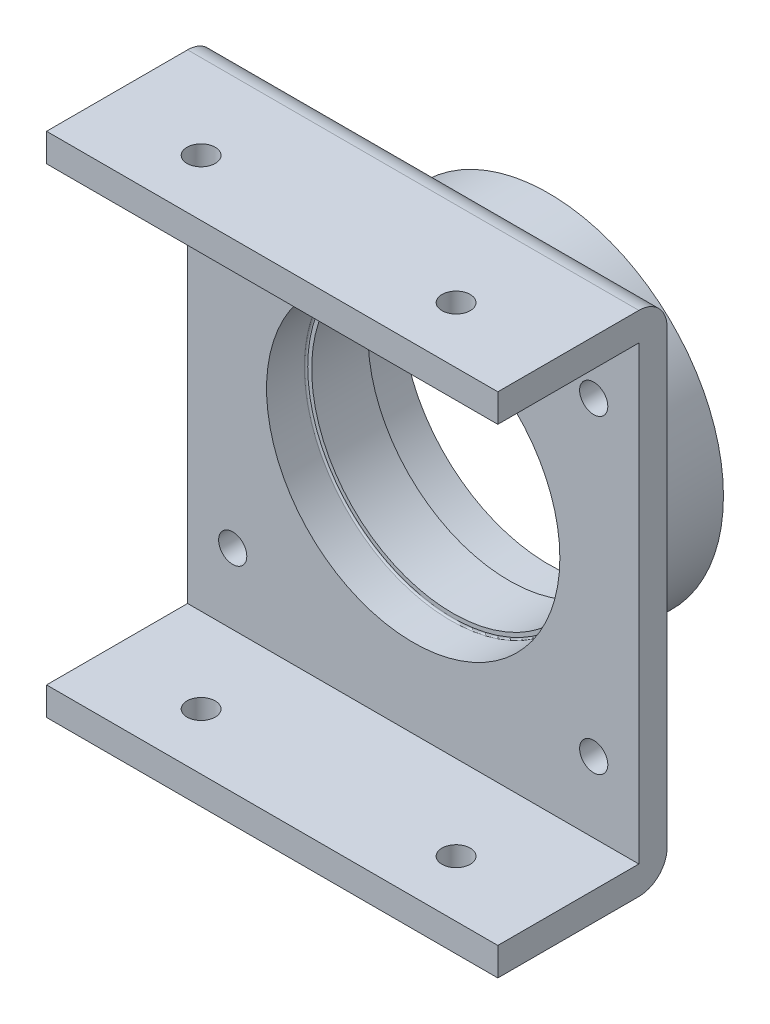
ISO-10303-21;
HEADER;
FILE_DESCRIPTION(('STEP AP214'),'2;1');
FILE_NAME('part.step','',(''),(''),'','','');
FILE_SCHEMA(('AUTOMOTIVE_DESIGN { 1 0 10303 214 1 1 1 1 }'));
ENDSEC;
DATA;
#1=APPLICATION_CONTEXT('core data for automotive mechanical design processes');
#2=APPLICATION_PROTOCOL_DEFINITION('international standard','automotive_design',2000,#1);
#3=PRODUCT_CONTEXT('',#1,'mechanical');
#4=PRODUCT('Part','Part','',(#3));
#5=PRODUCT_RELATED_PRODUCT_CATEGORY('part','',(#4));
#6=PRODUCT_DEFINITION_FORMATION('','',#4);
#7=PRODUCT_DEFINITION_CONTEXT('part definition',#1,'design');
#8=PRODUCT_DEFINITION('design','',#6,#7);
#9=PRODUCT_DEFINITION_SHAPE('','',#8);
#10=(LENGTH_UNIT() NAMED_UNIT(*) SI_UNIT(.MILLI.,.METRE.));
#11=(NAMED_UNIT(*) PLANE_ANGLE_UNIT() SI_UNIT($,.RADIAN.));
#12=(NAMED_UNIT(*) SI_UNIT($,.STERADIAN.) SOLID_ANGLE_UNIT());
#13=UNCERTAINTY_MEASURE_WITH_UNIT(LENGTH_MEASURE(1.E-05),#10,'distance_accuracy_value','');
#14=(GEOMETRIC_REPRESENTATION_CONTEXT(3) GLOBAL_UNCERTAINTY_ASSIGNED_CONTEXT((#13)) GLOBAL_UNIT_ASSIGNED_CONTEXT((#10,
#11,#12)) REPRESENTATION_CONTEXT('',''));
#15=CARTESIAN_POINT('',(0.,0.,0.));
#16=DIRECTION('',(0.,0.,1.));
#17=DIRECTION('',(1.,0.,0.));
#18=AXIS2_PLACEMENT_3D('',#15,#16,#17);
#19=CARTESIAN_POINT('',(0.,0.,17.));
#20=DIRECTION('',(0.,0.,1.));
#21=DIRECTION('',(1.,0.,0.));
#22=AXIS2_PLACEMENT_3D('',#19,#20,#21);
#23=PLANE('',#22);
#24=CARTESIAN_POINT('',(0.,0.,17.));
#25=DIRECTION('',(0.,0.,1.));
#26=DIRECTION('',(1.,0.,0.));
#27=AXIS2_PLACEMENT_3D('',#24,#25,#26);
#28=CIRCLE('',#27,25.7);
#29=CARTESIAN_POINT('',(25.7,0.,17.));
#30=VERTEX_POINT('',#29);
#31=EDGE_CURVE('E265',#30,#30,#28,.T.);
#32=ORIENTED_EDGE('',*,*,#31,.T.);
#33=EDGE_LOOP('',(#32));
#34=FACE_BOUND('',#33,.T.);
#35=CARTESIAN_POINT('',(0.,0.,17.));
#36=DIRECTION('',(0.,0.,1.));
#37=DIRECTION('',(1.,0.,0.));
#38=AXIS2_PLACEMENT_3D('',#35,#36,#37);
#39=CIRCLE('',#38,25.);
#40=CARTESIAN_POINT('',(25.,0.,17.));
#41=VERTEX_POINT('',#40);
#42=EDGE_CURVE('E242',#41,#41,#39,.T.);
#43=ORIENTED_EDGE('',*,*,#42,.F.);
#44=EDGE_LOOP('',(#43));
#45=FACE_BOUND('',#44,.T.);
#46=ADVANCED_FACE('F43',(#34,#45),#23,.T.);
#47=CARTESIAN_POINT('',(0.,0.,0.));
#48=DIRECTION('',(0.,0.,1.));
#49=DIRECTION('',(1.,0.,0.));
#50=AXIS2_PLACEMENT_3D('',#47,#48,#49);
#51=PLANE('',#50);
#52=CARTESIAN_POINT('',(0.,0.,0.));
#53=DIRECTION('',(0.,0.,1.));
#54=DIRECTION('',(1.,0.,0.));
#55=AXIS2_PLACEMENT_3D('',#52,#53,#54);
#56=CIRCLE('',#55,31.);
#57=CARTESIAN_POINT('',(31.,0.,0.));
#58=VERTEX_POINT('',#57);
#59=EDGE_CURVE('E253',#58,#58,#56,.T.);
#60=ORIENTED_EDGE('',*,*,#59,.F.);
#61=EDGE_LOOP('',(#60));
#62=FACE_BOUND('',#61,.T.);
#63=CARTESIAN_POINT('',(0.,0.,0.));
#64=DIRECTION('',(0.,0.,1.));
#65=DIRECTION('',(1.,0.,0.));
#66=AXIS2_PLACEMENT_3D('',#63,#64,#65);
#67=CIRCLE('',#66,26.);
#68=CARTESIAN_POINT('',(26.,0.,0.));
#69=VERTEX_POINT('',#68);
#70=EDGE_CURVE('E246',#69,#69,#67,.T.);
#71=ORIENTED_EDGE('',*,*,#70,.T.);
#72=EDGE_LOOP('',(#71));
#73=FACE_BOUND('',#72,.T.);
#74=ADVANCED_FACE('F351',(#62,#73),#51,.F.);
#75=CARTESIAN_POINT('',(0.,0.,7.));
#76=DIRECTION('',(0.,0.,-1.));
#77=DIRECTION('',(-1.,0.,0.));
#78=AXIS2_PLACEMENT_3D('',#75,#76,#77);
#79=CYLINDRICAL_SURFACE('',#78,31.);
#80=CARTESIAN_POINT('',(0.,0.,17.));
#81=DIRECTION('',(0.,0.,-1.));
#82=DIRECTION('',(-1.,0.,0.));
#83=AXIS2_PLACEMENT_3D('',#80,#81,#82);
#84=CIRCLE('',#83,31.);
#85=CARTESIAN_POINT('',(-31.,0.,17.));
#86=VERTEX_POINT('',#85);
#87=EDGE_CURVE('E277',#86,#86,#84,.T.);
#88=ORIENTED_EDGE('',*,*,#87,.T.);
#89=EDGE_LOOP('',(#88));
#90=FACE_BOUND('',#89,.T.);
#91=ORIENTED_EDGE('',*,*,#59,.T.);
#92=EDGE_LOOP('',(#91));
#93=FACE_BOUND('',#92,.T.);
#94=ADVANCED_FACE('F357',(#90,#93),#79,.T.);
#95=CARTESIAN_POINT('',(0.,0.,7.));
#96=DIRECTION('',(0.,0.,-1.));
#97=DIRECTION('',(-1.,0.,0.));
#98=AXIS2_PLACEMENT_3D('',#95,#96,#97);
#99=CYLINDRICAL_SURFACE('',#98,26.);
#100=CARTESIAN_POINT('',(0.,0.,6.7));
#101=DIRECTION('',(0.,0.,1.));
#102=DIRECTION('',(1.,0.,0.));
#103=AXIS2_PLACEMENT_3D('',#100,#101,#102);
#104=CIRCLE('',#103,26.);
#105=CARTESIAN_POINT('',(26.,0.,6.7));
#106=VERTEX_POINT('',#105);
#107=EDGE_CURVE('E257',#106,#106,#104,.T.);
#108=ORIENTED_EDGE('',*,*,#107,.T.);
#109=EDGE_LOOP('',(#108));
#110=FACE_BOUND('',#109,.T.);
#111=ORIENTED_EDGE('',*,*,#70,.F.);
#112=EDGE_LOOP('',(#111));
#113=FACE_BOUND('',#112,.T.);
#114=ADVANCED_FACE('F368',(#110,#113),#99,.F.);
#115=CARTESIAN_POINT('',(0.,0.,7.));
#116=DIRECTION('',(0.,0.,1.));
#117=DIRECTION('',(1.,0.,0.));
#118=AXIS2_PLACEMENT_3D('',#115,#116,#117);
#119=PLANE('',#118);
#120=CARTESIAN_POINT('',(0.,0.,7.));
#121=DIRECTION('',(0.,0.,1.));
#122=DIRECTION('',(1.,0.,0.));
#123=AXIS2_PLACEMENT_3D('',#120,#121,#122);
#124=CIRCLE('',#123,25.7);
#125=CARTESIAN_POINT('',(25.7,0.,7.));
#126=VERTEX_POINT('',#125);
#127=EDGE_CURVE('E261',#126,#126,#124,.F.);
#128=ORIENTED_EDGE('',*,*,#127,.T.);
#129=EDGE_LOOP('',(#128));
#130=FACE_BOUND('',#129,.T.);
#131=CARTESIAN_POINT('',(0.,0.,7.));
#132=DIRECTION('',(0.,0.,1.));
#133=DIRECTION('',(1.,0.,0.));
#134=AXIS2_PLACEMENT_3D('',#131,#132,#133);
#135=CIRCLE('',#134,25.);
#136=CARTESIAN_POINT('',(25.,0.,7.));
#137=VERTEX_POINT('',#136);
#138=EDGE_CURVE('E241',#137,#137,#135,.T.);
#139=ORIENTED_EDGE('',*,*,#138,.T.);
#140=EDGE_LOOP('',(#139));
#141=FACE_BOUND('',#140,.T.);
#142=ADVANCED_FACE('F365',(#130,#141),#119,.F.);
#143=CARTESIAN_POINT('',(0.,0.,17.));
#144=DIRECTION('',(0.,0.,-1.));
#145=DIRECTION('',(-1.,0.,0.));
#146=AXIS2_PLACEMENT_3D('',#143,#144,#145);
#147=CYLINDRICAL_SURFACE('',#146,25.);
#148=ORIENTED_EDGE('',*,*,#42,.T.);
#149=EDGE_LOOP('',(#148));
#150=FACE_BOUND('',#149,.T.);
#151=ORIENTED_EDGE('',*,*,#138,.F.);
#152=EDGE_LOOP('',(#151));
#153=FACE_BOUND('',#152,.T.);
#154=ADVANCED_FACE('F363',(#150,#153),#147,.F.);
#155=CARTESIAN_POINT('',(0.,0.,24.));
#156=DIRECTION('',(0.,0.,1.));
#157=DIRECTION('',(1.,0.,0.));
#158=AXIS2_PLACEMENT_3D('',#155,#156,#157);
#159=PLANE('',#158);
#160=CARTESIAN_POINT('',(-32.,27.5,24.));
#161=DIRECTION('',(0.,0.,1.));
#162=DIRECTION('',(1.,0.,0.));
#163=AXIS2_PLACEMENT_3D('',#160,#161,#162);
#164=CIRCLE('',#163,2.49999999999999);
#165=CARTESIAN_POINT('',(-29.5,27.5,24.));
#166=VERTEX_POINT('',#165);
#167=EDGE_CURVE('E194',#166,#166,#164,.T.);
#168=ORIENTED_EDGE('',*,*,#167,.F.);
#169=EDGE_LOOP('',(#168));
#170=FACE_BOUND('',#169,.T.);
#171=CARTESIAN_POINT('',(32.,27.5,24.));
#172=DIRECTION('',(0.,0.,1.));
#173=DIRECTION('',(1.,0.,0.));
#174=AXIS2_PLACEMENT_3D('',#171,#172,#173);
#175=CIRCLE('',#174,2.49999999999999);
#176=CARTESIAN_POINT('',(34.5,27.5,24.));
#177=VERTEX_POINT('',#176);
#178=EDGE_CURVE('E199',#177,#177,#175,.T.);
#179=ORIENTED_EDGE('',*,*,#178,.F.);
#180=EDGE_LOOP('',(#179));
#181=FACE_BOUND('',#180,.T.);
#182=CARTESIAN_POINT('',(32.,-27.5,24.));
#183=DIRECTION('',(0.,0.,1.));
#184=DIRECTION('',(1.,0.,0.));
#185=AXIS2_PLACEMENT_3D('',#182,#183,#184);
#186=CIRCLE('',#185,2.49999999999999);
#187=CARTESIAN_POINT('',(34.5,-27.5,24.));
#188=VERTEX_POINT('',#187);
#189=EDGE_CURVE('E207',#188,#188,#186,.T.);
#190=ORIENTED_EDGE('',*,*,#189,.F.);
#191=EDGE_LOOP('',(#190));
#192=FACE_BOUND('',#191,.T.);
#193=CARTESIAN_POINT('',(-32.,-27.5,24.));
#194=DIRECTION('',(0.,0.,1.));
#195=DIRECTION('',(1.,0.,0.));
#196=AXIS2_PLACEMENT_3D('',#193,#194,#195);
#197=CIRCLE('',#196,2.49999999999999);
#198=CARTESIAN_POINT('',(-29.5,-27.5,24.));
#199=VERTEX_POINT('',#198);
#200=EDGE_CURVE('E212',#199,#199,#197,.T.);
#201=ORIENTED_EDGE('',*,*,#200,.F.);
#202=EDGE_LOOP('',(#201));
#203=FACE_BOUND('',#202,.T.);
#204=CARTESIAN_POINT('',(0.,0.,24.));
#205=DIRECTION('',(0.,0.,1.));
#206=DIRECTION('',(1.,0.,0.));
#207=AXIS2_PLACEMENT_3D('',#204,#205,#206);
#208=CIRCLE('',#207,26.);
#209=CARTESIAN_POINT('',(26.,0.,24.));
#210=VERTEX_POINT('',#209);
#211=EDGE_CURVE('E224',#210,#210,#208,.T.);
#212=ORIENTED_EDGE('',*,*,#211,.F.);
#213=EDGE_LOOP('',(#212));
#214=FACE_BOUND('',#213,.T.);
#215=DIRECTION('',(0.,1.,0.));
#216=VECTOR('',#215,1.);
#217=CARTESIAN_POINT('',(40.,-40.,24.));
#218=LINE('',#217,#216);
#219=CARTESIAN_POINT('',(40.,-40.,24.));
#220=VERTEX_POINT('',#219);
#221=CARTESIAN_POINT('',(40.,40.,24.));
#222=VERTEX_POINT('',#221);
#223=EDGE_CURVE('E225',#220,#222,#218,.T.);
#224=ORIENTED_EDGE('',*,*,#223,.T.);
#225=DIRECTION('',(-1.,0.,0.));
#226=VECTOR('',#225,1.);
#227=CARTESIAN_POINT('',(-40.,40.,24.));
#228=LINE('',#227,#226);
#229=CARTESIAN_POINT('',(-40.,40.,24.));
#230=VERTEX_POINT('',#229);
#231=EDGE_CURVE('E229',#222,#230,#228,.T.);
#232=ORIENTED_EDGE('',*,*,#231,.T.);
#233=DIRECTION('',(0.,-1.,0.));
#234=VECTOR('',#233,1.);
#235=CARTESIAN_POINT('',(-40.,-40.,24.));
#236=LINE('',#235,#234);
#237=CARTESIAN_POINT('',(-40.,-40.,24.));
#238=VERTEX_POINT('',#237);
#239=EDGE_CURVE('E233',#230,#238,#236,.T.);
#240=ORIENTED_EDGE('',*,*,#239,.T.);
#241=DIRECTION('',(1.,0.,0.));
#242=VECTOR('',#241,1.);
#243=CARTESIAN_POINT('',(-40.,-40.,24.));
#244=LINE('',#243,#242);
#245=EDGE_CURVE('E129',#238,#220,#244,.T.);
#246=ORIENTED_EDGE('',*,*,#245,.T.);
#247=EDGE_LOOP('',(#224,#232,#240,#246));
#248=FACE_BOUND('',#247,.T.);
#249=ADVANCED_FACE('F331',(#170,#181,#192,#203,#214,#248),#159,.T.);
#250=CARTESIAN_POINT('',(0.,0.,24.));
#251=DIRECTION('',(0.,0.,-1.));
#252=DIRECTION('',(-1.,0.,0.));
#253=AXIS2_PLACEMENT_3D('',#250,#251,#252);
#254=CYLINDRICAL_SURFACE('',#253,26.);
#255=CARTESIAN_POINT('',(0.,0.,17.3));
#256=DIRECTION('',(0.,0.,1.));
#257=DIRECTION('',(1.,0.,0.));
#258=AXIS2_PLACEMENT_3D('',#255,#256,#257);
#259=CIRCLE('',#258,26.);
#260=CARTESIAN_POINT('',(26.,0.,17.3));
#261=VERTEX_POINT('',#260);
#262=EDGE_CURVE('E269',#261,#261,#259,.F.);
#263=ORIENTED_EDGE('',*,*,#262,.T.);
#264=EDGE_LOOP('',(#263));
#265=FACE_BOUND('',#264,.T.);
#266=ORIENTED_EDGE('',*,*,#211,.T.);
#267=EDGE_LOOP('',(#266));
#268=FACE_BOUND('',#267,.T.);
#269=ADVANCED_FACE('F380',(#265,#268),#254,.F.);
#270=CARTESIAN_POINT('',(0.,0.,6.7));
#271=DIRECTION('',(0.,0.,1.));
#272=DIRECTION('',(1.,0.,0.));
#273=AXIS2_PLACEMENT_3D('',#270,#271,#272);
#274=TOROIDAL_SURFACE('',#273,25.7,0.3);
#275=ORIENTED_EDGE('',*,*,#127,.F.);
#276=EDGE_LOOP('',(#275));
#277=FACE_BOUND('',#276,.T.);
#278=ORIENTED_EDGE('',*,*,#107,.F.);
#279=EDGE_LOOP('',(#278));
#280=FACE_BOUND('',#279,.T.);
#281=ADVANCED_FACE('F376',(#277,#280),#274,.F.);
#282=CARTESIAN_POINT('',(0.,0.,17.3));
#283=DIRECTION('',(0.,0.,1.));
#284=DIRECTION('',(1.,0.,0.));
#285=AXIS2_PLACEMENT_3D('',#282,#283,#284);
#286=TOROIDAL_SURFACE('',#285,25.7,0.3);
#287=ORIENTED_EDGE('',*,*,#262,.F.);
#288=EDGE_LOOP('',(#287));
#289=FACE_BOUND('',#288,.T.);
#290=ORIENTED_EDGE('',*,*,#31,.F.);
#291=EDGE_LOOP('',(#290));
#292=FACE_BOUND('',#291,.T.);
#293=ADVANCED_FACE('F379',(#289,#292),#286,.F.);
#294=CARTESIAN_POINT('',(40.,-40.,19.));
#295=DIRECTION('',(1.,0.,0.));
#296=DIRECTION('',(0.,0.,-1.));
#297=AXIS2_PLACEMENT_3D('',#294,#295,#296);
#298=PLANE('',#297);
#299=DIRECTION('',(0.,0.,-1.));
#300=VECTOR('',#299,1.);
#301=CARTESIAN_POINT('',(40.,-45.,19.));
#302=LINE('',#301,#300);
#303=CARTESIAN_POINT('',(40.,-45.,49.));
#304=VERTEX_POINT('',#303);
#305=CARTESIAN_POINT('',(40.,-45.,24.));
#306=VERTEX_POINT('',#305);
#307=EDGE_CURVE('E135',#304,#306,#302,.T.);
#308=ORIENTED_EDGE('',*,*,#307,.T.);
#309=CARTESIAN_POINT('',(40.,-40.,24.));
#310=DIRECTION('',(1.,0.,0.));
#311=DIRECTION('',(0.,0.,-1.));
#312=AXIS2_PLACEMENT_3D('',#309,#310,#311);
#313=CIRCLE('',#312,5.);
#314=CARTESIAN_POINT('',(40.,-40.,19.));
#315=VERTEX_POINT('',#314);
#316=EDGE_CURVE('E297',#306,#315,#313,.T.);
#317=ORIENTED_EDGE('',*,*,#316,.T.);
#318=DIRECTION('',(0.,1.,0.));
#319=VECTOR('',#318,1.);
#320=CARTESIAN_POINT('',(40.,-40.,19.));
#321=LINE('',#320,#319);
#322=CARTESIAN_POINT('',(40.,40.,19.));
#323=VERTEX_POINT('',#322);
#324=EDGE_CURVE('E217',#315,#323,#321,.T.);
#325=ORIENTED_EDGE('',*,*,#324,.T.);
#326=CARTESIAN_POINT('',(40.,40.,24.));
#327=DIRECTION('',(1.,0.,0.));
#328=DIRECTION('',(0.,0.,-1.));
#329=AXIS2_PLACEMENT_3D('',#326,#327,#328);
#330=CIRCLE('',#329,5.);
#331=CARTESIAN_POINT('',(40.,45.,24.));
#332=VERTEX_POINT('',#331);
#333=EDGE_CURVE('E294',#323,#332,#330,.T.);
#334=ORIENTED_EDGE('',*,*,#333,.T.);
#335=DIRECTION('',(0.,0.,1.));
#336=VECTOR('',#335,1.);
#337=CARTESIAN_POINT('',(40.,45.,19.));
#338=LINE('',#337,#336);
#339=CARTESIAN_POINT('',(40.,45.,49.));
#340=VERTEX_POINT('',#339);
#341=EDGE_CURVE('E181',#332,#340,#338,.T.);
#342=ORIENTED_EDGE('',*,*,#341,.T.);
#343=DIRECTION('',(0.,-1.,0.));
#344=VECTOR('',#343,1.);
#345=CARTESIAN_POINT('',(40.,45.,49.));
#346=LINE('',#345,#344);
#347=CARTESIAN_POINT('',(40.,40.,49.));
#348=VERTEX_POINT('',#347);
#349=EDGE_CURVE('E157',#340,#348,#346,.T.);
#350=ORIENTED_EDGE('',*,*,#349,.T.);
#351=DIRECTION('',(0.,0.,-1.));
#352=VECTOR('',#351,1.);
#353=CARTESIAN_POINT('',(40.,40.,19.));
#354=LINE('',#353,#352);
#355=EDGE_CURVE('E182',#348,#222,#354,.T.);
#356=ORIENTED_EDGE('',*,*,#355,.T.);
#357=ORIENTED_EDGE('',*,*,#223,.F.);
#358=DIRECTION('',(0.,0.,1.));
#359=VECTOR('',#358,1.);
#360=CARTESIAN_POINT('',(40.,-40.,19.));
#361=LINE('',#360,#359);
#362=CARTESIAN_POINT('',(40.,-40.,49.));
#363=VERTEX_POINT('',#362);
#364=EDGE_CURVE('E170',#220,#363,#361,.T.);
#365=ORIENTED_EDGE('',*,*,#364,.T.);
#366=DIRECTION('',(0.,-1.,0.));
#367=VECTOR('',#366,1.);
#368=CARTESIAN_POINT('',(40.,-40.,49.));
#369=LINE('',#368,#367);
#370=EDGE_CURVE('E149',#363,#304,#369,.T.);
#371=ORIENTED_EDGE('',*,*,#370,.T.);
#372=EDGE_LOOP('',(#308,#317,#325,#334,#342,#350,#356,#357,#365,#371));
#373=FACE_BOUND('',#372,.T.);
#374=ADVANCED_FACE('F316',(#373),#298,.T.);
#375=CARTESIAN_POINT('',(-40.,-40.,19.));
#376=DIRECTION('',(-1.,0.,0.));
#377=DIRECTION('',(0.,0.,1.));
#378=AXIS2_PLACEMENT_3D('',#375,#376,#377);
#379=PLANE('',#378);
#380=DIRECTION('',(0.,-1.,0.));
#381=VECTOR('',#380,1.);
#382=CARTESIAN_POINT('',(-40.,-40.,19.));
#383=LINE('',#382,#381);
#384=CARTESIAN_POINT('',(-40.,40.,19.));
#385=VERTEX_POINT('',#384);
#386=CARTESIAN_POINT('',(-40.,-40.,19.));
#387=VERTEX_POINT('',#386);
#388=EDGE_CURVE('E221',#385,#387,#383,.T.);
#389=ORIENTED_EDGE('',*,*,#388,.T.);
#390=CARTESIAN_POINT('',(-40.,-40.,24.));
#391=DIRECTION('',(-1.,0.,0.));
#392=DIRECTION('',(0.,0.,1.));
#393=AXIS2_PLACEMENT_3D('',#390,#391,#392);
#394=CIRCLE('',#393,5.);
#395=CARTESIAN_POINT('',(-40.,-45.,24.));
#396=VERTEX_POINT('',#395);
#397=EDGE_CURVE('E52',#387,#396,#394,.T.);
#398=ORIENTED_EDGE('',*,*,#397,.T.);
#399=DIRECTION('',(0.,0.,-1.));
#400=VECTOR('',#399,1.);
#401=CARTESIAN_POINT('',(-40.,-45.,19.));
#402=LINE('',#401,#400);
#403=CARTESIAN_POINT('',(-40.,-45.,49.));
#404=VERTEX_POINT('',#403);
#405=EDGE_CURVE('E134',#404,#396,#402,.T.);
#406=ORIENTED_EDGE('',*,*,#405,.F.);
#407=DIRECTION('',(0.,-1.,0.));
#408=VECTOR('',#407,1.);
#409=CARTESIAN_POINT('',(-40.,-40.,49.));
#410=LINE('',#409,#408);
#411=CARTESIAN_POINT('',(-40.,-40.,49.));
#412=VERTEX_POINT('',#411);
#413=EDGE_CURVE('E138',#412,#404,#410,.T.);
#414=ORIENTED_EDGE('',*,*,#413,.F.);
#415=DIRECTION('',(0.,0.,1.));
#416=VECTOR('',#415,1.);
#417=CARTESIAN_POINT('',(-40.,-40.,19.));
#418=LINE('',#417,#416);
#419=EDGE_CURVE('E122',#238,#412,#418,.T.);
#420=ORIENTED_EDGE('',*,*,#419,.F.);
#421=ORIENTED_EDGE('',*,*,#239,.F.);
#422=DIRECTION('',(0.,0.,-1.));
#423=VECTOR('',#422,1.);
#424=CARTESIAN_POINT('',(-40.,40.,19.));
#425=LINE('',#424,#423);
#426=CARTESIAN_POINT('',(-40.,40.,49.));
#427=VERTEX_POINT('',#426);
#428=EDGE_CURVE('E191',#427,#230,#425,.T.);
#429=ORIENTED_EDGE('',*,*,#428,.F.);
#430=DIRECTION('',(0.,-1.,0.));
#431=VECTOR('',#430,1.);
#432=CARTESIAN_POINT('',(-40.,45.,49.));
#433=LINE('',#432,#431);
#434=CARTESIAN_POINT('',(-40.,45.,49.));
#435=VERTEX_POINT('',#434);
#436=EDGE_CURVE('E162',#435,#427,#433,.T.);
#437=ORIENTED_EDGE('',*,*,#436,.F.);
#438=DIRECTION('',(0.,0.,1.));
#439=VECTOR('',#438,1.);
#440=CARTESIAN_POINT('',(-40.,45.,19.));
#441=LINE('',#440,#439);
#442=CARTESIAN_POINT('',(-40.,45.,24.));
#443=VERTEX_POINT('',#442);
#444=EDGE_CURVE('E186',#443,#435,#441,.T.);
#445=ORIENTED_EDGE('',*,*,#444,.F.);
#446=CARTESIAN_POINT('',(-40.,40.,24.));
#447=DIRECTION('',(-1.,0.,0.));
#448=DIRECTION('',(0.,0.,1.));
#449=AXIS2_PLACEMENT_3D('',#446,#447,#448);
#450=CIRCLE('',#449,5.);
#451=EDGE_CURVE('E306',#443,#385,#450,.T.);
#452=ORIENTED_EDGE('',*,*,#451,.T.);
#453=EDGE_LOOP('',(#389,#398,#406,#414,#420,#421,#429,#437,#445,#452));
#454=FACE_BOUND('',#453,.T.);
#455=ADVANCED_FACE('F139',(#454),#379,.T.);
#456=CARTESIAN_POINT('',(0.,0.,19.));
#457=DIRECTION('',(0.,0.,-1.));
#458=DIRECTION('',(-1.,0.,0.));
#459=AXIS2_PLACEMENT_3D('',#456,#457,#458);
#460=PLANE('',#459);
#461=CARTESIAN_POINT('',(-32.,27.5,19.));
#462=DIRECTION('',(0.,0.,-1.));
#463=DIRECTION('',(-1.,0.,0.));
#464=AXIS2_PLACEMENT_3D('',#461,#462,#463);
#465=CIRCLE('',#464,2.49999999999999);
#466=CARTESIAN_POINT('',(-34.5,27.5,19.));
#467=VERTEX_POINT('',#466);
#468=EDGE_CURVE('E198',#467,#467,#465,.T.);
#469=ORIENTED_EDGE('',*,*,#468,.F.);
#470=EDGE_LOOP('',(#469));
#471=FACE_BOUND('',#470,.T.);
#472=CARTESIAN_POINT('',(32.,27.5,19.));
#473=DIRECTION('',(0.,0.,-1.));
#474=DIRECTION('',(-1.,0.,0.));
#475=AXIS2_PLACEMENT_3D('',#472,#473,#474);
#476=CIRCLE('',#475,2.49999999999999);
#477=CARTESIAN_POINT('',(29.5,27.5,19.));
#478=VERTEX_POINT('',#477);
#479=EDGE_CURVE('E203',#478,#478,#476,.T.);
#480=ORIENTED_EDGE('',*,*,#479,.F.);
#481=EDGE_LOOP('',(#480));
#482=FACE_BOUND('',#481,.T.);
#483=CARTESIAN_POINT('',(32.,-27.5,19.));
#484=DIRECTION('',(0.,0.,-1.));
#485=DIRECTION('',(-1.,0.,0.));
#486=AXIS2_PLACEMENT_3D('',#483,#484,#485);
#487=CIRCLE('',#486,2.49999999999999);
#488=CARTESIAN_POINT('',(29.5,-27.5,19.));
#489=VERTEX_POINT('',#488);
#490=EDGE_CURVE('E211',#489,#489,#487,.T.);
#491=ORIENTED_EDGE('',*,*,#490,.F.);
#492=EDGE_LOOP('',(#491));
#493=FACE_BOUND('',#492,.T.);
#494=CARTESIAN_POINT('',(-32.,-27.5,19.));
#495=DIRECTION('',(0.,0.,-1.));
#496=DIRECTION('',(-1.,0.,0.));
#497=AXIS2_PLACEMENT_3D('',#494,#495,#496);
#498=CIRCLE('',#497,2.49999999999999);
#499=CARTESIAN_POINT('',(-34.5,-27.5,19.));
#500=VERTEX_POINT('',#499);
#501=EDGE_CURVE('E216',#500,#500,#498,.T.);
#502=ORIENTED_EDGE('',*,*,#501,.F.);
#503=EDGE_LOOP('',(#502));
#504=FACE_BOUND('',#503,.T.);
#505=CARTESIAN_POINT('',(0.,0.,19.));
#506=DIRECTION('',(0.,0.,-1.));
#507=DIRECTION('',(-1.,0.,0.));
#508=AXIS2_PLACEMENT_3D('',#505,#506,#507);
#509=CIRCLE('',#508,33.);
#510=CARTESIAN_POINT('',(-33.,0.,19.));
#511=VERTEX_POINT('',#510);
#512=EDGE_CURVE('E273',#511,#511,#509,.F.);
#513=ORIENTED_EDGE('',*,*,#512,.T.);
#514=EDGE_LOOP('',(#513));
#515=FACE_BOUND('',#514,.T.);
#516=ORIENTED_EDGE('',*,*,#324,.F.);
#517=DIRECTION('',(1.,0.,0.));
#518=VECTOR('',#517,1.);
#519=CARTESIAN_POINT('',(0.,-40.,19.));
#520=LINE('',#519,#518);
#521=EDGE_CURVE('E65',#315,#387,#520,.F.);
#522=ORIENTED_EDGE('',*,*,#521,.T.);
#523=ORIENTED_EDGE('',*,*,#388,.F.);
#524=DIRECTION('',(1.,0.,0.));
#525=VECTOR('',#524,1.);
#526=CARTESIAN_POINT('',(0.,40.,19.));
#527=LINE('',#526,#525);
#528=EDGE_CURVE('E300',#385,#323,#527,.T.);
#529=ORIENTED_EDGE('',*,*,#528,.T.);
#530=EDGE_LOOP('',(#516,#522,#523,#529));
#531=FACE_BOUND('',#530,.T.);
#532=ADVANCED_FACE('F317',(#471,#482,#493,#504,#515,#531),#460,.T.);
#533=CARTESIAN_POINT('',(0.,0.,17.));
#534=DIRECTION('',(0.,0.,-1.));
#535=DIRECTION('',(-1.,0.,0.));
#536=AXIS2_PLACEMENT_3D('',#533,#534,#535);
#537=TOROIDAL_SURFACE('',#536,33.,2.);
#538=ORIENTED_EDGE('',*,*,#87,.F.);
#539=EDGE_LOOP('',(#538));
#540=FACE_BOUND('',#539,.T.);
#541=ORIENTED_EDGE('',*,*,#512,.F.);
#542=EDGE_LOOP('',(#541));
#543=FACE_BOUND('',#542,.T.);
#544=ADVANCED_FACE('F385',(#540,#543),#537,.F.);
#545=CARTESIAN_POINT('',(-32.,-27.5,24.));
#546=DIRECTION('',(0.,0.,1.));
#547=DIRECTION('',(1.,0.,0.));
#548=AXIS2_PLACEMENT_3D('',#545,#546,#547);
#549=CYLINDRICAL_SURFACE('',#548,2.49999999999999);
#550=ORIENTED_EDGE('',*,*,#501,.T.);
#551=EDGE_LOOP('',(#550));
#552=FACE_BOUND('',#551,.T.);
#553=ORIENTED_EDGE('',*,*,#200,.T.);
#554=EDGE_LOOP('',(#553));
#555=FACE_BOUND('',#554,.T.);
#556=ADVANCED_FACE('F387',(#552,#555),#549,.F.);
#557=CARTESIAN_POINT('',(32.,-27.5,24.));
#558=DIRECTION('',(0.,0.,1.));
#559=DIRECTION('',(1.,0.,0.));
#560=AXIS2_PLACEMENT_3D('',#557,#558,#559);
#561=CYLINDRICAL_SURFACE('',#560,2.49999999999999);
#562=ORIENTED_EDGE('',*,*,#490,.T.);
#563=EDGE_LOOP('',(#562));
#564=FACE_BOUND('',#563,.T.);
#565=ORIENTED_EDGE('',*,*,#189,.T.);
#566=EDGE_LOOP('',(#565));
#567=FACE_BOUND('',#566,.T.);
#568=ADVANCED_FACE('F599',(#564,#567),#561,.F.);
#569=CARTESIAN_POINT('',(32.,27.5,24.));
#570=DIRECTION('',(0.,0.,1.));
#571=DIRECTION('',(1.,0.,0.));
#572=AXIS2_PLACEMENT_3D('',#569,#570,#571);
#573=CYLINDRICAL_SURFACE('',#572,2.49999999999999);
#574=ORIENTED_EDGE('',*,*,#479,.T.);
#575=EDGE_LOOP('',(#574));
#576=FACE_BOUND('',#575,.T.);
#577=ORIENTED_EDGE('',*,*,#178,.T.);
#578=EDGE_LOOP('',(#577));
#579=FACE_BOUND('',#578,.T.);
#580=ADVANCED_FACE('F344',(#576,#579),#573,.F.);
#581=CARTESIAN_POINT('',(-32.,27.5,24.));
#582=DIRECTION('',(0.,0.,1.));
#583=DIRECTION('',(1.,0.,0.));
#584=AXIS2_PLACEMENT_3D('',#581,#582,#583);
#585=CYLINDRICAL_SURFACE('',#584,2.49999999999999);
#586=ORIENTED_EDGE('',*,*,#468,.T.);
#587=EDGE_LOOP('',(#586));
#588=FACE_BOUND('',#587,.T.);
#589=ORIENTED_EDGE('',*,*,#167,.T.);
#590=EDGE_LOOP('',(#589));
#591=FACE_BOUND('',#590,.T.);
#592=ADVANCED_FACE('F334',(#588,#591),#585,.F.);
#593=CARTESIAN_POINT('',(-51.1803398874989,40.,19.));
#594=DIRECTION('',(0.,-1.,0.));
#595=DIRECTION('',(0.,0.,-1.));
#596=AXIS2_PLACEMENT_3D('',#593,#594,#595);
#597=PLANE('',#596);
#598=CARTESIAN_POINT('',(-22.6,40.,39.));
#599=DIRECTION('',(0.,-1.,0.));
#600=DIRECTION('',(0.,0.,-1.));
#601=AXIS2_PLACEMENT_3D('',#598,#599,#600);
#602=CIRCLE('',#601,2.49999999999999);
#603=CARTESIAN_POINT('',(-22.6,40.,36.5));
#604=VERTEX_POINT('',#603);
#605=EDGE_CURVE('E433',#604,#604,#602,.T.);
#606=ORIENTED_EDGE('',*,*,#605,.F.);
#607=EDGE_LOOP('',(#606));
#608=FACE_BOUND('',#607,.T.);
#609=CARTESIAN_POINT('',(22.6,40.,39.));
#610=DIRECTION('',(0.,-1.,0.));
#611=DIRECTION('',(0.,0.,-1.));
#612=AXIS2_PLACEMENT_3D('',#609,#610,#611);
#613=CIRCLE('',#612,2.49999999999999);
#614=CARTESIAN_POINT('',(22.6,40.,36.5));
#615=VERTEX_POINT('',#614);
#616=EDGE_CURVE('E153',#615,#615,#613,.T.);
#617=ORIENTED_EDGE('',*,*,#616,.F.);
#618=EDGE_LOOP('',(#617));
#619=FACE_BOUND('',#618,.T.);
#620=ORIENTED_EDGE('',*,*,#231,.F.);
#621=ORIENTED_EDGE('',*,*,#355,.F.);
#622=DIRECTION('',(1.,0.,0.));
#623=VECTOR('',#622,1.);
#624=CARTESIAN_POINT('',(-60.6155281280883,40.,49.));
#625=LINE('',#624,#623);
#626=EDGE_CURVE('E166',#427,#348,#625,.T.);
#627=ORIENTED_EDGE('',*,*,#626,.F.);
#628=ORIENTED_EDGE('',*,*,#428,.T.);
#629=EDGE_LOOP('',(#620,#621,#627,#628));
#630=FACE_BOUND('',#629,.T.);
#631=ADVANCED_FACE('F332',(#608,#619,#630),#597,.T.);
#632=CARTESIAN_POINT('',(-51.1803398874989,45.,19.));
#633=DIRECTION('',(0.,1.,0.));
#634=DIRECTION('',(0.,0.,1.));
#635=AXIS2_PLACEMENT_3D('',#632,#633,#634);
#636=PLANE('',#635);
#637=CARTESIAN_POINT('',(-22.6,45.,39.));
#638=DIRECTION('',(0.,1.,0.));
#639=DIRECTION('',(0.,0.,1.));
#640=AXIS2_PLACEMENT_3D('',#637,#638,#639);
#641=CIRCLE('',#640,2.49999999999999);
#642=CARTESIAN_POINT('',(-22.6,45.,41.5));
#643=VERTEX_POINT('',#642);
#644=EDGE_CURVE('E429',#643,#643,#641,.T.);
#645=ORIENTED_EDGE('',*,*,#644,.F.);
#646=EDGE_LOOP('',(#645));
#647=FACE_BOUND('',#646,.T.);
#648=CARTESIAN_POINT('',(22.6,45.,39.));
#649=DIRECTION('',(0.,1.,0.));
#650=DIRECTION('',(0.,0.,1.));
#651=AXIS2_PLACEMENT_3D('',#648,#649,#650);
#652=CIRCLE('',#651,2.49999999999999);
#653=CARTESIAN_POINT('',(22.6,45.,41.5));
#654=VERTEX_POINT('',#653);
#655=EDGE_CURVE('E441',#654,#654,#652,.T.);
#656=ORIENTED_EDGE('',*,*,#655,.F.);
#657=EDGE_LOOP('',(#656));
#658=FACE_BOUND('',#657,.T.);
#659=ORIENTED_EDGE('',*,*,#341,.F.);
#660=DIRECTION('',(1.,0.,0.));
#661=VECTOR('',#660,1.);
#662=CARTESIAN_POINT('',(-51.1803398874989,45.,24.));
#663=LINE('',#662,#661);
#664=EDGE_CURVE('E11',#332,#443,#663,.F.);
#665=ORIENTED_EDGE('',*,*,#664,.T.);
#666=ORIENTED_EDGE('',*,*,#444,.T.);
#667=DIRECTION('',(1.,0.,0.));
#668=VECTOR('',#667,1.);
#669=CARTESIAN_POINT('',(-60.6155281280883,45.,49.));
#670=LINE('',#669,#668);
#671=EDGE_CURVE('E161',#435,#340,#670,.T.);
#672=ORIENTED_EDGE('',*,*,#671,.T.);
#673=EDGE_LOOP('',(#659,#665,#666,#672));
#674=FACE_BOUND('',#673,.T.);
#675=ADVANCED_FACE('F321',(#647,#658,#674),#636,.T.);
#676=CARTESIAN_POINT('',(-51.1803398874989,-40.,19.));
#677=DIRECTION('',(0.,1.,0.));
#678=DIRECTION('',(0.,0.,1.));
#679=AXIS2_PLACEMENT_3D('',#676,#677,#678);
#680=PLANE('',#679);
#681=CARTESIAN_POINT('',(-22.6,-40.,39.));
#682=DIRECTION('',(0.,1.,0.));
#683=DIRECTION('',(0.,0.,1.));
#684=AXIS2_PLACEMENT_3D('',#681,#682,#683);
#685=CIRCLE('',#684,2.49999999999999);
#686=CARTESIAN_POINT('',(-22.6,-40.,41.5));
#687=VERTEX_POINT('',#686);
#688=EDGE_CURVE('E425',#687,#687,#685,.T.);
#689=ORIENTED_EDGE('',*,*,#688,.F.);
#690=EDGE_LOOP('',(#689));
#691=FACE_BOUND('',#690,.T.);
#692=CARTESIAN_POINT('',(22.6,-40.,39.));
#693=DIRECTION('',(0.,1.,0.));
#694=DIRECTION('',(0.,0.,1.));
#695=AXIS2_PLACEMENT_3D('',#692,#693,#694);
#696=CIRCLE('',#695,2.49999999999999);
#697=CARTESIAN_POINT('',(22.6,-40.,41.5));
#698=VERTEX_POINT('',#697);
#699=EDGE_CURVE('E449',#698,#698,#696,.T.);
#700=ORIENTED_EDGE('',*,*,#699,.F.);
#701=EDGE_LOOP('',(#700));
#702=FACE_BOUND('',#701,.T.);
#703=ORIENTED_EDGE('',*,*,#245,.F.);
#704=ORIENTED_EDGE('',*,*,#419,.T.);
#705=DIRECTION('',(1.,0.,0.));
#706=VECTOR('',#705,1.);
#707=CARTESIAN_POINT('',(-60.6155281280883,-40.,49.));
#708=LINE('',#707,#706);
#709=EDGE_CURVE('E126',#412,#363,#708,.T.);
#710=ORIENTED_EDGE('',*,*,#709,.T.);
#711=ORIENTED_EDGE('',*,*,#364,.F.);
#712=EDGE_LOOP('',(#703,#704,#710,#711));
#713=FACE_BOUND('',#712,.T.);
#714=ADVANCED_FACE('F124',(#691,#702,#713),#680,.T.);
#715=CARTESIAN_POINT('',(-51.1803398874989,-45.,19.));
#716=DIRECTION('',(0.,-1.,0.));
#717=DIRECTION('',(0.,0.,-1.));
#718=AXIS2_PLACEMENT_3D('',#715,#716,#717);
#719=PLANE('',#718);
#720=CARTESIAN_POINT('',(-22.6,-45.,39.));
#721=DIRECTION('',(0.,1.,0.));
#722=DIRECTION('',(0.,0.,1.));
#723=AXIS2_PLACEMENT_3D('',#720,#721,#722);
#724=CIRCLE('',#723,2.49999999999999);
#725=CARTESIAN_POINT('',(-22.6,-45.,41.5));
#726=VERTEX_POINT('',#725);
#727=EDGE_CURVE('E427',#726,#726,#724,.T.);
#728=ORIENTED_EDGE('',*,*,#727,.T.);
#729=EDGE_LOOP('',(#728));
#730=FACE_BOUND('',#729,.T.);
#731=CARTESIAN_POINT('',(22.6,-45.,39.));
#732=DIRECTION('',(0.,1.,0.));
#733=DIRECTION('',(0.,0.,1.));
#734=AXIS2_PLACEMENT_3D('',#731,#732,#733);
#735=CIRCLE('',#734,2.49999999999999);
#736=CARTESIAN_POINT('',(22.6,-45.,41.5));
#737=VERTEX_POINT('',#736);
#738=EDGE_CURVE('E445',#737,#737,#735,.T.);
#739=ORIENTED_EDGE('',*,*,#738,.T.);
#740=EDGE_LOOP('',(#739));
#741=FACE_BOUND('',#740,.T.);
#742=ORIENTED_EDGE('',*,*,#405,.T.);
#743=DIRECTION('',(1.,0.,0.));
#744=VECTOR('',#743,1.);
#745=CARTESIAN_POINT('',(-51.1803398874989,-45.,24.));
#746=LINE('',#745,#744);
#747=EDGE_CURVE('E281',#396,#306,#746,.T.);
#748=ORIENTED_EDGE('',*,*,#747,.T.);
#749=ORIENTED_EDGE('',*,*,#307,.F.);
#750=DIRECTION('',(1.,0.,0.));
#751=VECTOR('',#750,1.);
#752=CARTESIAN_POINT('',(-60.6155281280883,-45.,49.));
#753=LINE('',#752,#751);
#754=EDGE_CURVE('E145',#404,#304,#753,.T.);
#755=ORIENTED_EDGE('',*,*,#754,.F.);
#756=EDGE_LOOP('',(#742,#748,#749,#755));
#757=FACE_BOUND('',#756,.T.);
#758=ADVANCED_FACE('F313',(#730,#741,#757),#719,.T.);
#759=CARTESIAN_POINT('',(-51.1803398874989,-40.,24.));
#760=DIRECTION('',(1.,0.,0.));
#761=DIRECTION('',(0.,0.,-1.));
#762=AXIS2_PLACEMENT_3D('',#759,#760,#761);
#763=CYLINDRICAL_SURFACE('',#762,5.);
#764=ORIENTED_EDGE('',*,*,#397,.F.);
#765=ORIENTED_EDGE('',*,*,#521,.F.);
#766=ORIENTED_EDGE('',*,*,#316,.F.);
#767=ORIENTED_EDGE('',*,*,#747,.F.);
#768=EDGE_LOOP('',(#764,#765,#766,#767));
#769=FACE_BOUND('',#768,.T.);
#770=ADVANCED_FACE('F314',(#769),#763,.T.);
#771=CARTESIAN_POINT('',(0.,40.,24.));
#772=DIRECTION('',(1.,0.,0.));
#773=DIRECTION('',(0.,0.,-1.));
#774=AXIS2_PLACEMENT_3D('',#771,#772,#773);
#775=CYLINDRICAL_SURFACE('',#774,5.);
#776=ORIENTED_EDGE('',*,*,#451,.F.);
#777=ORIENTED_EDGE('',*,*,#664,.F.);
#778=ORIENTED_EDGE('',*,*,#333,.F.);
#779=ORIENTED_EDGE('',*,*,#528,.F.);
#780=EDGE_LOOP('',(#776,#777,#778,#779));
#781=FACE_BOUND('',#780,.T.);
#782=ADVANCED_FACE('F45',(#781),#775,.T.);
#783=CARTESIAN_POINT('',(-60.6155281280883,45.,49.));
#784=DIRECTION('',(0.,0.,1.));
#785=DIRECTION('',(1.,0.,0.));
#786=AXIS2_PLACEMENT_3D('',#783,#784,#785);
#787=PLANE('',#786);
#788=ORIENTED_EDGE('',*,*,#671,.F.);
#789=ORIENTED_EDGE('',*,*,#436,.T.);
#790=ORIENTED_EDGE('',*,*,#626,.T.);
#791=ORIENTED_EDGE('',*,*,#349,.F.);
#792=EDGE_LOOP('',(#788,#789,#790,#791));
#793=FACE_BOUND('',#792,.T.);
#794=ADVANCED_FACE('F326',(#793),#787,.T.);
#795=CARTESIAN_POINT('',(-60.6155281280883,-40.,49.));
#796=DIRECTION('',(0.,0.,1.));
#797=DIRECTION('',(1.,0.,0.));
#798=AXIS2_PLACEMENT_3D('',#795,#796,#797);
#799=PLANE('',#798);
#800=ORIENTED_EDGE('',*,*,#709,.F.);
#801=ORIENTED_EDGE('',*,*,#413,.T.);
#802=ORIENTED_EDGE('',*,*,#754,.T.);
#803=ORIENTED_EDGE('',*,*,#370,.F.);
#804=EDGE_LOOP('',(#800,#801,#802,#803));
#805=FACE_BOUND('',#804,.T.);
#806=ADVANCED_FACE('F147',(#805),#799,.T.);
#807=CARTESIAN_POINT('',(22.6,45.,39.));
#808=DIRECTION('',(0.,1.,0.));
#809=DIRECTION('',(0.,0.,1.));
#810=AXIS2_PLACEMENT_3D('',#807,#808,#809);
#811=CYLINDRICAL_SURFACE('',#810,2.49999999999999);
#812=ORIENTED_EDGE('',*,*,#699,.T.);
#813=EDGE_LOOP('',(#812));
#814=FACE_BOUND('',#813,.T.);
#815=ORIENTED_EDGE('',*,*,#738,.F.);
#816=EDGE_LOOP('',(#815));
#817=FACE_BOUND('',#816,.T.);
#818=ADVANCED_FACE('F407',(#814,#817),#811,.F.);
#819=ORIENTED_EDGE('',*,*,#616,.T.);
#820=EDGE_LOOP('',(#819));
#821=FACE_BOUND('',#820,.T.);
#822=ORIENTED_EDGE('',*,*,#655,.T.);
#823=EDGE_LOOP('',(#822));
#824=FACE_BOUND('',#823,.T.);
#825=ADVANCED_FACE('F410',(#821,#824),#811,.F.);
#826=CARTESIAN_POINT('',(-22.6,45.,39.));
#827=DIRECTION('',(0.,1.,0.));
#828=DIRECTION('',(0.,0.,1.));
#829=AXIS2_PLACEMENT_3D('',#826,#827,#828);
#830=CYLINDRICAL_SURFACE('',#829,2.49999999999999);
#831=ORIENTED_EDGE('',*,*,#688,.T.);
#832=EDGE_LOOP('',(#831));
#833=FACE_BOUND('',#832,.T.);
#834=ORIENTED_EDGE('',*,*,#727,.F.);
#835=EDGE_LOOP('',(#834));
#836=FACE_BOUND('',#835,.T.);
#837=ADVANCED_FACE('F412',(#833,#836),#830,.F.);
#838=ORIENTED_EDGE('',*,*,#605,.T.);
#839=EDGE_LOOP('',(#838));
#840=FACE_BOUND('',#839,.T.);
#841=ORIENTED_EDGE('',*,*,#644,.T.);
#842=EDGE_LOOP('',(#841));
#843=FACE_BOUND('',#842,.T.);
#844=ADVANCED_FACE('F414',(#840,#843),#830,.F.);
#845=CLOSED_SHELL('',(#46,#74,#94,#114,#142,#154,#249,#269,#281,#293,#374,#455,#532,#544,#556,
#568,#580,#592,#631,#675,#714,#758,#770,#782,#794,#806,#818,#825,#837,#844));
#846=MANIFOLD_SOLID_BREP('B2',#845);
#847=ADVANCED_BREP_SHAPE_REPRESENTATION('',(#18,#846),#14);
#848=SHAPE_DEFINITION_REPRESENTATION(#9,#847);
ENDSEC;
END-ISO-10303-21;
